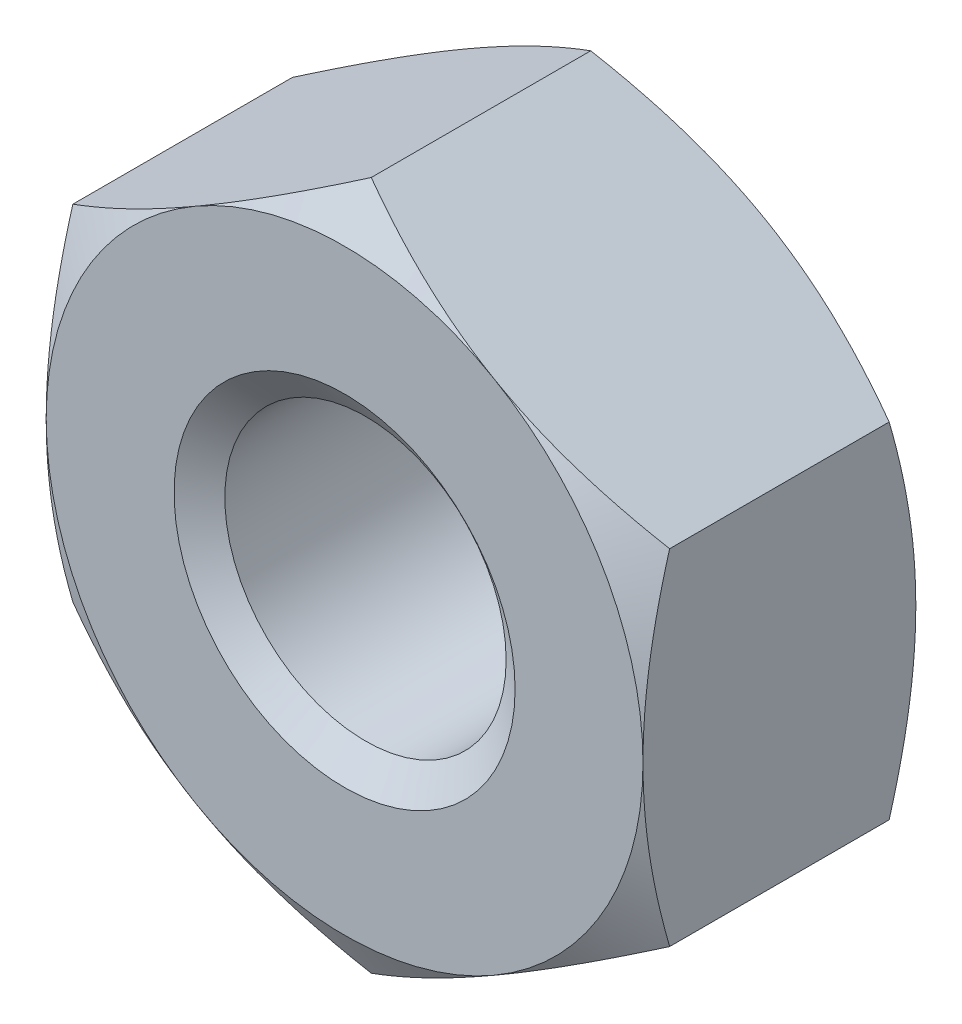
ISO-10303-21;
HEADER;
FILE_DESCRIPTION(('STEP AP214'),'2;1');
FILE_NAME('part.step','',(''),(''),'','','');
FILE_SCHEMA(('AUTOMOTIVE_DESIGN { 1 0 10303 214 1 1 1 1 }'));
ENDSEC;
DATA;
#1=APPLICATION_CONTEXT('core data for automotive mechanical design processes');
#2=APPLICATION_PROTOCOL_DEFINITION('international standard','automotive_design',2000,#1);
#3=PRODUCT_CONTEXT('',#1,'mechanical');
#4=PRODUCT('Part','Part','',(#3));
#5=PRODUCT_RELATED_PRODUCT_CATEGORY('part','',(#4));
#6=PRODUCT_DEFINITION_FORMATION('','',#4);
#7=PRODUCT_DEFINITION_CONTEXT('part definition',#1,'design');
#8=PRODUCT_DEFINITION('design','',#6,#7);
#9=PRODUCT_DEFINITION_SHAPE('','',#8);
#10=(LENGTH_UNIT() NAMED_UNIT(*) SI_UNIT(.MILLI.,.METRE.));
#11=(NAMED_UNIT(*) PLANE_ANGLE_UNIT() SI_UNIT($,.RADIAN.));
#12=(NAMED_UNIT(*) SI_UNIT($,.STERADIAN.) SOLID_ANGLE_UNIT());
#13=UNCERTAINTY_MEASURE_WITH_UNIT(LENGTH_MEASURE(1.E-05),#10,'distance_accuracy_value','');
#14=(GEOMETRIC_REPRESENTATION_CONTEXT(3) GLOBAL_UNCERTAINTY_ASSIGNED_CONTEXT((#13)) GLOBAL_UNIT_ASSIGNED_CONTEXT((#10,
#11,#12)) REPRESENTATION_CONTEXT('',''));
#15=CARTESIAN_POINT('',(0.,0.,0.));
#16=DIRECTION('',(0.,0.,1.));
#17=DIRECTION('',(1.,0.,0.));
#18=AXIS2_PLACEMENT_3D('',#15,#16,#17);
#19=CARTESIAN_POINT('',(0.,0.,-3.2));
#20=DIRECTION('',(0.,0.,1.));
#21=DIRECTION('',(1.,0.,0.));
#22=AXIS2_PLACEMENT_3D('',#19,#20,#21);
#23=CYLINDRICAL_SURFACE('',#22,1.65);
#24=CARTESIAN_POINT('',(0.,0.,-0.245072638373399));
#25=DIRECTION('',(0.,0.,1.));
#26=DIRECTION('',(1.,0.,0.));
#27=AXIS2_PLACEMENT_3D('',#24,#25,#26);
#28=CIRCLE('',#27,1.65);
#29=CARTESIAN_POINT('',(1.65,0.,-0.245072638373399));
#30=VERTEX_POINT('',#29);
#31=EDGE_CURVE('E176',#30,#30,#28,.F.);
#32=ORIENTED_EDGE('',*,*,#31,.F.);
#33=EDGE_LOOP('',(#32));
#34=FACE_BOUND('',#33,.T.);
#35=CARTESIAN_POINT('',(0.,0.,-2.9295273616266));
#36=DIRECTION('',(0.,0.,-1.));
#37=DIRECTION('',(-1.,0.,0.));
#38=AXIS2_PLACEMENT_3D('',#35,#36,#37);
#39=CIRCLE('',#38,1.65);
#40=CARTESIAN_POINT('',(-1.65,0.,-2.9295273616266));
#41=VERTEX_POINT('',#40);
#42=EDGE_CURVE('E41',#41,#41,#39,.F.);
#43=ORIENTED_EDGE('',*,*,#42,.F.);
#44=EDGE_LOOP('',(#43));
#45=FACE_BOUND('',#44,.T.);
#46=ADVANCED_FACE('F36',(#34,#45),#23,.F.);
#47=CARTESIAN_POINT('',(0.,4.04145188432738,-3.2));
#48=DIRECTION('',(-0.500000000000001,0.866025403784438,0.));
#49=DIRECTION('',(-0.866025403784438,-0.500000000000001,0.));
#50=AXIS2_PLACEMENT_3D('',#47,#48,#49);
#51=PLANE('',#50);
#52=DIRECTION('',(0.,0.,1.));
#53=VECTOR('',#52,1.);
#54=CARTESIAN_POINT('',(-3.5,2.02072594216369,-3.2));
#55=LINE('',#54,#53);
#56=CARTESIAN_POINT('',(-3.5,2.02072594216369,-2.88739260883036));
#57=VERTEX_POINT('',#56);
#58=CARTESIAN_POINT('',(-3.5,2.02072594216369,-0.312607391169643));
#59=VERTEX_POINT('',#58);
#60=EDGE_CURVE('E166',#57,#59,#55,.T.);
#61=ORIENTED_EDGE('',*,*,#60,.T.);
#62=CARTESIAN_POINT('',(-3.5002,2.02061047210985,-0.312674060693371));
#63=CARTESIAN_POINT('',(-3.34639282154755,2.10941108799267,-0.261385788989983));
#64=CARTESIAN_POINT('',(-3.19125798916558,2.19897822522909,-0.214740953816197));
#65=CARTESIAN_POINT('',(-2.87830199342322,2.37966345361545,-0.133321875533348));
#66=CARTESIAN_POINT('',(-2.7204752692125,2.47078475532382,-0.0985764355845608));
#67=CARTESIAN_POINT('',(-2.40677778961987,2.65189807961073,-0.0444900271828354));
#68=CARTESIAN_POINT('',(-2.25095530083931,2.74186223545399,-0.0247890862603809));
#69=CARTESIAN_POINT('',(-1.93857711279463,2.92221386641056,-0.00127013273725365));
#70=CARTESIAN_POINT('',(-1.78202254896577,3.01260068598001,0.00256735545443562));
#71=CARTESIAN_POINT('',(-1.48949078007901,3.1814939814933,-0.00541530187697704));
#72=CARTESIAN_POINT('',(-1.35346978754209,3.26002573814993,-0.0152754340696068));
#73=CARTESIAN_POINT('',(-1.08231397971101,3.41657761679354,-0.0465264668994035));
#74=CARTESIAN_POINT('',(-0.947180102315318,3.49459719728458,-0.0679280432857982));
#75=CARTESIAN_POINT('',(-0.675465207594817,3.65147186489429,-0.121430407880577));
#76=CARTESIAN_POINT('',(-0.538918580721665,3.73030709667644,-0.153757994445087));
#77=CARTESIAN_POINT('',(-0.267861907055499,3.88680174018324,-0.227128933807995));
#78=CARTESIAN_POINT('',(-0.133348387531464,3.96446315689009,-0.268155046569868));
#79=CARTESIAN_POINT('',(0.000199999999999524,4.04156735438122,-0.312674060693372));
#80=B_SPLINE_CURVE_WITH_KNOTS('',3,(#62,#63,#64,#65,#66,#67,#68,#69,#70,#71,#72,#73,#74,#75,#76,
#77,#78,#79),.UNSPECIFIED.,.F.,.F.,(4,2,2,2,2,2,2,2,4),(0.,0.554793832886254,1.11092123814984,
1.65328467083219,2.19498204478403,2.6666513085086,3.13875761298267,3.6213361260051,
4.10296698719187),.UNSPECIFIED.);
#81=CARTESIAN_POINT('',(-1.75,3.03108891324553,0.));
#82=VERTEX_POINT('',#81);
#83=EDGE_CURVE('E135',#59,#82,#80,.T.);
#84=ORIENTED_EDGE('',*,*,#83,.T.);
#85=CARTESIAN_POINT('',(0.,4.04145188432738,-0.312607391169644));
#86=VERTEX_POINT('',#85);
#87=EDGE_CURVE('E55',#82,#86,#80,.T.);
#88=ORIENTED_EDGE('',*,*,#87,.T.);
#89=DIRECTION('',(0.,0.,1.));
#90=VECTOR('',#89,1.);
#91=CARTESIAN_POINT('',(0.,4.04145188432738,-3.2));
#92=LINE('',#91,#90);
#93=CARTESIAN_POINT('',(0.,4.04145188432738,-2.88739260883036));
#94=VERTEX_POINT('',#93);
#95=EDGE_CURVE('E151',#94,#86,#92,.T.);
#96=ORIENTED_EDGE('',*,*,#95,.F.);
#97=CARTESIAN_POINT('',(-3.5002,2.02061047210985,-2.88732593930663));
#98=CARTESIAN_POINT('',(-3.34639282154755,2.10941108799267,-2.93861421101002));
#99=CARTESIAN_POINT('',(-3.19125798916558,2.19897822522909,-2.9852590461838));
#100=CARTESIAN_POINT('',(-2.87830199342322,2.37966345361545,-3.06667812446665));
#101=CARTESIAN_POINT('',(-2.7204752692125,2.47078475532382,-3.10142356441544));
#102=CARTESIAN_POINT('',(-2.40677778961987,2.65189807961073,-3.15550997281716));
#103=CARTESIAN_POINT('',(-2.25095530083931,2.74186223545399,-3.17521091373962));
#104=CARTESIAN_POINT('',(-1.93857711279463,2.92221386641055,-3.19872986726275));
#105=CARTESIAN_POINT('',(-1.78202254896577,3.01260068598001,-3.20256735545444));
#106=CARTESIAN_POINT('',(-1.48949078007901,3.1814939814933,-3.19458469812302));
#107=CARTESIAN_POINT('',(-1.35346978754209,3.26002573814993,-3.18472456593039));
#108=CARTESIAN_POINT('',(-1.08231397971101,3.41657761679354,-3.1534735331006));
#109=CARTESIAN_POINT('',(-0.947180102315318,3.49459719728458,-3.1320719567142));
#110=CARTESIAN_POINT('',(-0.675465207594817,3.65147186489429,-3.07856959211942));
#111=CARTESIAN_POINT('',(-0.538918580721665,3.73030709667644,-3.04624200555491));
#112=CARTESIAN_POINT('',(-0.267861907055499,3.88680174018324,-2.97287106619201));
#113=CARTESIAN_POINT('',(-0.133348387531464,3.96446315689009,-2.93184495343013));
#114=CARTESIAN_POINT('',(0.000199999999999536,4.04156735438122,-2.88732593930663));
#115=B_SPLINE_CURVE_WITH_KNOTS('',3,(#97,#98,#99,#100,#101,#102,#103,#104,#105,#106,#107,#108,
#109,#110,#111,#112,#113,#114),.UNSPECIFIED.,.F.,.F.,(4,2,2,2,2,2,2,2,4),(0.,0.554793832886254,
1.11092123814984,1.65328467083219,2.19498204478403,2.6666513085086,3.13875761298267,
3.6213361260051,4.10296698719187),.UNSPECIFIED.);
#116=CARTESIAN_POINT('',(-1.75,3.03108891324553,-3.2));
#117=VERTEX_POINT('',#116);
#118=EDGE_CURVE('E169',#117,#94,#115,.T.);
#119=ORIENTED_EDGE('',*,*,#118,.F.);
#120=EDGE_CURVE('E268',#57,#117,#115,.T.);
#121=ORIENTED_EDGE('',*,*,#120,.F.);
#122=EDGE_LOOP('',(#61,#84,#88,#96,#119,#121));
#123=FACE_BOUND('',#122,.T.);
#124=ADVANCED_FACE('F38',(#123),#51,.T.);
#125=CARTESIAN_POINT('',(3.5,2.02072594216369,-3.2));
#126=DIRECTION('',(0.5,0.866025403784438,0.));
#127=DIRECTION('',(-0.866025403784438,0.5,0.));
#128=AXIS2_PLACEMENT_3D('',#125,#126,#127);
#129=PLANE('',#128);
#130=ORIENTED_EDGE('',*,*,#95,.T.);
#131=CARTESIAN_POINT('',(-0.000200000000000528,4.04156735438122,-0.312674060693372));
#132=CARTESIAN_POINT('',(0.153607178452449,3.9527667384984,-0.261385788989985));
#133=CARTESIAN_POINT('',(0.308742010834424,3.86319960126198,-0.214740953816198));
#134=CARTESIAN_POINT('',(0.621698006576781,3.68251437287562,-0.133321875533349));
#135=CARTESIAN_POINT('',(0.779524730787496,3.59139307116725,-0.0985764355845617));
#136=CARTESIAN_POINT('',(1.09322221038013,3.41027974688034,-0.044490027182836));
#137=CARTESIAN_POINT('',(1.24904469916069,3.32031559103708,-0.0247890862603814));
#138=CARTESIAN_POINT('',(1.56142288720537,3.13996396008052,-0.00127013273725395));
#139=CARTESIAN_POINT('',(1.71797745103423,3.04957714051106,0.0025673554544353));
#140=CARTESIAN_POINT('',(2.01050921992099,2.88068384499777,-0.00541530187697722));
#141=CARTESIAN_POINT('',(2.14653021245791,2.80215208834114,-0.0152754340696068));
#142=CARTESIAN_POINT('',(2.417686020289,2.64560020969753,-0.0465264668994033));
#143=CARTESIAN_POINT('',(2.55281989768468,2.5675806292065,-0.0679280432857978));
#144=CARTESIAN_POINT('',(2.82453479240518,2.41070596159678,-0.121430407880577));
#145=CARTESIAN_POINT('',(2.96108141927834,2.33187072981463,-0.153757994445087));
#146=CARTESIAN_POINT('',(3.2321380929445,2.17537608630783,-0.227128933807994));
#147=CARTESIAN_POINT('',(3.36665161246854,2.09771466960098,-0.268155046569867));
#148=CARTESIAN_POINT('',(3.5002,2.02061047210985,-0.312674060693371));
#149=B_SPLINE_CURVE_WITH_KNOTS('',3,(#131,#132,#133,#134,#135,#136,#137,#138,#139,#140,#141,
#142,#143,#144,#145,#146,#147,#148),.UNSPECIFIED.,.F.,.F.,(4,2,2,2,2,2,2,2,4),(0.,
0.554793832886254,1.11092123814984,1.65328467083219,2.19498204478403,2.6666513085086,
3.13875761298267,3.6213361260051,4.10296698719187),.UNSPECIFIED.);
#150=CARTESIAN_POINT('',(1.75,3.03108891324554,0.));
#151=VERTEX_POINT('',#150);
#152=EDGE_CURVE('E145',#86,#151,#149,.T.);
#153=ORIENTED_EDGE('',*,*,#152,.T.);
#154=CARTESIAN_POINT('',(3.5,2.02072594216369,-0.312607391169644));
#155=VERTEX_POINT('',#154);
#156=EDGE_CURVE('E62',#151,#155,#149,.T.);
#157=ORIENTED_EDGE('',*,*,#156,.T.);
#158=DIRECTION('',(0.,0.,1.));
#159=VECTOR('',#158,1.);
#160=CARTESIAN_POINT('',(3.5,2.02072594216369,-3.2));
#161=LINE('',#160,#159);
#162=CARTESIAN_POINT('',(3.5,2.02072594216369,-2.88739260883036));
#163=VERTEX_POINT('',#162);
#164=EDGE_CURVE('E144',#163,#155,#161,.T.);
#165=ORIENTED_EDGE('',*,*,#164,.F.);
#166=CARTESIAN_POINT('',(-0.000200000000000514,4.04156735438122,-2.88732593930663));
#167=CARTESIAN_POINT('',(0.153607178452449,3.9527667384984,-2.93861421101002));
#168=CARTESIAN_POINT('',(0.308742010834424,3.86319960126198,-2.9852590461838));
#169=CARTESIAN_POINT('',(0.621698006576781,3.68251437287562,-3.06667812446665));
#170=CARTESIAN_POINT('',(0.779524730787496,3.59139307116725,-3.10142356441544));
#171=CARTESIAN_POINT('',(1.09322221038013,3.41027974688034,-3.15550997281716));
#172=CARTESIAN_POINT('',(1.24904469916069,3.32031559103708,-3.17521091373962));
#173=CARTESIAN_POINT('',(1.56142288720537,3.13996396008052,-3.19872986726275));
#174=CARTESIAN_POINT('',(1.71797745103423,3.04957714051106,-3.20256735545444));
#175=CARTESIAN_POINT('',(2.01050921992099,2.88068384499777,-3.19458469812302));
#176=CARTESIAN_POINT('',(2.14653021245791,2.80215208834114,-3.18472456593039));
#177=CARTESIAN_POINT('',(2.417686020289,2.64560020969753,-3.1534735331006));
#178=CARTESIAN_POINT('',(2.55281989768468,2.5675806292065,-3.1320719567142));
#179=CARTESIAN_POINT('',(2.82453479240518,2.41070596159678,-3.07856959211942));
#180=CARTESIAN_POINT('',(2.96108141927834,2.33187072981463,-3.04624200555491));
#181=CARTESIAN_POINT('',(3.2321380929445,2.17537608630783,-2.97287106619201));
#182=CARTESIAN_POINT('',(3.36665161246854,2.09771466960098,-2.93184495343013));
#183=CARTESIAN_POINT('',(3.5002,2.02061047210985,-2.88732593930663));
#184=B_SPLINE_CURVE_WITH_KNOTS('',3,(#166,#167,#168,#169,#170,#171,#172,#173,#174,#175,#176,
#177,#178,#179,#180,#181,#182,#183),.UNSPECIFIED.,.F.,.F.,(4,2,2,2,2,2,2,2,4),(0.,
0.554793832886254,1.11092123814984,1.65328467083219,2.19498204478403,2.6666513085086,
3.13875761298267,3.6213361260051,4.10296698719187),.UNSPECIFIED.);
#185=CARTESIAN_POINT('',(1.75,3.03108891324554,-3.2));
#186=VERTEX_POINT('',#185);
#187=EDGE_CURVE('E261',#186,#163,#184,.T.);
#188=ORIENTED_EDGE('',*,*,#187,.F.);
#189=EDGE_CURVE('E267',#94,#186,#184,.T.);
#190=ORIENTED_EDGE('',*,*,#189,.F.);
#191=EDGE_LOOP('',(#130,#153,#157,#165,#188,#190));
#192=FACE_BOUND('',#191,.T.);
#193=ADVANCED_FACE('F142',(#192),#129,.T.);
#194=CARTESIAN_POINT('',(3.5,2.02072594216369,-3.2));
#195=DIRECTION('',(-1.,0.,0.));
#196=DIRECTION('',(0.,0.,1.));
#197=AXIS2_PLACEMENT_3D('',#194,#195,#196);
#198=PLANE('',#197);
#199=CARTESIAN_POINT('',(3.5,-5.35926299121405,-1.67484346858556));
#200=CARTESIAN_POINT('',(3.5,-5.20559319908841,-1.60058173692104));
#201=CARTESIAN_POINT('',(3.5,-5.05156008083375,-1.52705822833147));
#202=CARTESIAN_POINT('',(3.5,-4.7425707418071,-1.38190950344752));
#203=CARTESIAN_POINT('',(3.5,-4.58761436682436,-1.31028461582133));
#204=CARTESIAN_POINT('',(3.5,-4.27574500225542,-1.16897765517624));
#205=CARTESIAN_POINT('',(3.5,-4.11882589028192,-1.09930904568016));
#206=CARTESIAN_POINT('',(3.5,-3.80369792903855,-0.962964262242759));
#207=CARTESIAN_POINT('',(3.5,-3.64548914750595,-0.896287932319517));
#208=CARTESIAN_POINT('',(3.5,-3.32556618401855,-0.765931819095066));
#209=CARTESIAN_POINT('',(3.5,-3.16383281219923,-0.702298873688864));
#210=CARTESIAN_POINT('',(3.5,-2.83845840945597,-0.580016702089492));
#211=CARTESIAN_POINT('',(3.5,-2.67481716858826,-0.521368030370691));
#212=CARTESIAN_POINT('',(3.5,-2.34570278472049,-0.410630279877021));
#213=CARTESIAN_POINT('',(3.5,-2.18023438248742,-0.358527255435857));
#214=CARTESIAN_POINT('',(3.5,-1.8469452280637,-0.262572936976443));
#215=CARTESIAN_POINT('',(3.5,-1.6791252378753,-0.218719033467158));
#216=CARTESIAN_POINT('',(3.5,-1.34101828610925,-0.141391945584786));
#217=CARTESIAN_POINT('',(3.5,-1.17073068027693,-0.107921525211972));
#218=CARTESIAN_POINT('',(3.5,-0.828102385138484,-0.0536149564320501));
#219=CARTESIAN_POINT('',(3.5,-0.655761694017301,-0.0327788191952362));
#220=CARTESIAN_POINT('',(3.5,-0.311020490924449,-0.00558408650575637));
#221=CARTESIAN_POINT('',(3.5,-0.138627397207259,0.00086616316591159));
#222=CARTESIAN_POINT('',(3.5,0.206038074906535,-0.00105355807794593));
#223=CARTESIAN_POINT('',(3.5,0.37831047302318,-0.00941968196343189));
#224=CARTESIAN_POINT('',(3.5,0.672490555822328,-0.0357688927868921));
#225=CARTESIAN_POINT('',(3.5,0.794722791084093,-0.0503206340384214));
#226=CARTESIAN_POINT('',(3.5,1.0382430543056,-0.0859367340533557));
#227=CARTESIAN_POINT('',(3.5,1.15953093025887,-0.107002119926141));
#228=CARTESIAN_POINT('',(3.5,1.52187914771348,-0.178863187081453));
#229=CARTESIAN_POINT('',(3.5,1.76124104212632,-0.23830527562201));
#230=CARTESIAN_POINT('',(3.5,2.11940971387709,-0.340826814402555));
#231=CARTESIAN_POINT('',(3.5,2.24008344316347,-0.377749699085184));
#232=CARTESIAN_POINT('',(3.5,2.48017139213729,-0.455249007699294));
#233=CARTESIAN_POINT('',(3.5,2.59958641795613,-0.495822911663551));
#234=CARTESIAN_POINT('',(3.5,2.83665760451799,-0.579779986782753));
#235=CARTESIAN_POINT('',(3.5,2.95431988203484,-0.623146060034315));
#236=CARTESIAN_POINT('',(3.5,3.188731535088,-0.712423559566866));
#237=CARTESIAN_POINT('',(3.5,3.30548051959464,-0.75833601459295));
#238=CARTESIAN_POINT('',(3.5,3.42180736613349,-0.805270380724071));
#239=B_SPLINE_CURVE_WITH_KNOTS('',3,(#199,#200,#201,#202,#203,#204,#205,#206,#207,#208,#209,
#210,#211,#212,#213,#214,#215,#216,#217,#218,#219,#220,#221,#222,#223,#224,#225,#226,#227,#228,
#229,#230,#231,#232,#233,#234,#235,#236,#237,#238),.UNSPECIFIED.,.F.,.F.,(4,2,2,2,2,2,2,2,2,2,2,
2,2,2,2,2,2,2,2,4),(0.,0.512025318465737,1.02413870177436,1.53918270315241,2.05419982499223,
2.57553975872798,3.09693761309353,3.617205066104,4.13730766217537,4.65754858684364,
5.17778997146961,5.69470725122282,6.211490334524,6.58059623222331,6.94976036239484,
7.68863804939851,8.06719621660478,8.4454950747676,8.82166461280099,9.1979872473341),.UNSPECIFIED.);
#240=CARTESIAN_POINT('',(3.5,-2.02072594216369,-0.312607391169644));
#241=VERTEX_POINT('',#240);
#242=CARTESIAN_POINT('',(3.5,0.,0.));
#243=VERTEX_POINT('',#242);
#244=EDGE_CURVE('E137',#241,#243,#239,.T.);
#245=ORIENTED_EDGE('',*,*,#244,.F.);
#246=DIRECTION('',(0.,0.,1.));
#247=VECTOR('',#246,1.);
#248=CARTESIAN_POINT('',(3.5,-2.02072594216369,-3.2));
#249=LINE('',#248,#247);
#250=CARTESIAN_POINT('',(3.5,-2.02072594216369,-2.88739260883036));
#251=VERTEX_POINT('',#250);
#252=EDGE_CURVE('E152',#251,#241,#249,.T.);
#253=ORIENTED_EDGE('',*,*,#252,.F.);
#254=CARTESIAN_POINT('',(3.5,-5.35926299121405,-1.52515653141444));
#255=CARTESIAN_POINT('',(3.5,-5.20559319908841,-1.59941826307896));
#256=CARTESIAN_POINT('',(3.5,-5.05156008083375,-1.67294177166853));
#257=CARTESIAN_POINT('',(3.5,-4.7425707418071,-1.81809049655248));
#258=CARTESIAN_POINT('',(3.5,-4.58761436682436,-1.88971538417867));
#259=CARTESIAN_POINT('',(3.5,-4.27574500225542,-2.03102234482376));
#260=CARTESIAN_POINT('',(3.5,-4.11882589028192,-2.10069095431984));
#261=CARTESIAN_POINT('',(3.5,-3.80369792903855,-2.23703573775724));
#262=CARTESIAN_POINT('',(3.5,-3.64548914750595,-2.30371206768048));
#263=CARTESIAN_POINT('',(3.5,-3.32556618401855,-2.43406818090493));
#264=CARTESIAN_POINT('',(3.5,-3.16383281219923,-2.49770112631114));
#265=CARTESIAN_POINT('',(3.5,-2.83845840945597,-2.61998329791051));
#266=CARTESIAN_POINT('',(3.5,-2.67481716858826,-2.67863196962931));
#267=CARTESIAN_POINT('',(3.5,-2.34570278472049,-2.78936972012298));
#268=CARTESIAN_POINT('',(3.5,-2.18023438248742,-2.84147274456414));
#269=CARTESIAN_POINT('',(3.5,-1.8469452280637,-2.93742706302356));
#270=CARTESIAN_POINT('',(3.5,-1.6791252378753,-2.98128096653284));
#271=CARTESIAN_POINT('',(3.5,-1.34101828610925,-3.05860805441521));
#272=CARTESIAN_POINT('',(3.5,-1.17073068027693,-3.09207847478803));
#273=CARTESIAN_POINT('',(3.5,-0.828102385138484,-3.14638504356795));
#274=CARTESIAN_POINT('',(3.5,-0.655761694017301,-3.16722118080476));
#275=CARTESIAN_POINT('',(3.5,-0.311020490924449,-3.19441591349424));
#276=CARTESIAN_POINT('',(3.5,-0.13862739720726,-3.20086616316591));
#277=CARTESIAN_POINT('',(3.5,0.206038074906535,-3.19894644192205));
#278=CARTESIAN_POINT('',(3.5,0.37831047302318,-3.19058031803657));
#279=CARTESIAN_POINT('',(3.5,0.672490555822328,-3.16423110721311));
#280=CARTESIAN_POINT('',(3.5,0.794722791084093,-3.14967936596158));
#281=CARTESIAN_POINT('',(3.5,1.0382430543056,-3.11406326594664));
#282=CARTESIAN_POINT('',(3.5,1.15953093025887,-3.09299788007386));
#283=CARTESIAN_POINT('',(3.5,1.52187914771348,-3.02113681291855));
#284=CARTESIAN_POINT('',(3.5,1.76124104212632,-2.96169472437799));
#285=CARTESIAN_POINT('',(3.5,2.11940971387709,-2.85917318559745));
#286=CARTESIAN_POINT('',(3.5,2.24008344316347,-2.82225030091482));
#287=CARTESIAN_POINT('',(3.5,2.48017139213729,-2.74475099230071));
#288=CARTESIAN_POINT('',(3.5,2.59958641795613,-2.70417708833645));
#289=CARTESIAN_POINT('',(3.5,2.83665760451799,-2.62022001321725));
#290=CARTESIAN_POINT('',(3.5,2.95431988203484,-2.57685393996569));
#291=CARTESIAN_POINT('',(3.5,3.188731535088,-2.48757644043313));
#292=CARTESIAN_POINT('',(3.5,3.30548051959464,-2.44166398540705));
#293=CARTESIAN_POINT('',(3.5,3.42180736613349,-2.39472961927593));
#294=B_SPLINE_CURVE_WITH_KNOTS('',3,(#254,#255,#256,#257,#258,#259,#260,#261,#262,#263,#264,
#265,#266,#267,#268,#269,#270,#271,#272,#273,#274,#275,#276,#277,#278,#279,#280,#281,#282,#283,
#284,#285,#286,#287,#288,#289,#290,#291,#292,#293),.UNSPECIFIED.,.F.,.F.,(4,2,2,2,2,2,2,2,2,2,2,
2,2,2,2,2,2,2,2,4),(0.,0.512025318465737,1.02413870177436,1.53918270315241,2.05419982499223,
2.57553975872798,3.09693761309353,3.617205066104,4.13730766217537,4.65754858684364,
5.17778997146961,5.69470725122282,6.211490334524,6.58059623222331,6.94976036239484,
7.68863804939851,8.06719621660478,8.4454950747676,8.82166461280099,9.1979872473341),.UNSPECIFIED.);
#295=CARTESIAN_POINT('',(3.5,0.,-3.2));
#296=VERTEX_POINT('',#295);
#297=EDGE_CURVE('E275',#251,#296,#294,.T.);
#298=ORIENTED_EDGE('',*,*,#297,.T.);
#299=EDGE_CURVE('E150',#296,#163,#294,.T.);
#300=ORIENTED_EDGE('',*,*,#299,.T.);
#301=ORIENTED_EDGE('',*,*,#164,.T.);
#302=EDGE_CURVE('E127',#243,#155,#239,.T.);
#303=ORIENTED_EDGE('',*,*,#302,.F.);
#304=EDGE_LOOP('',(#245,#253,#298,#300,#301,#303));
#305=FACE_BOUND('',#304,.T.);
#306=ADVANCED_FACE('F148',(#305),#198,.F.);
#307=CARTESIAN_POINT('',(0.,-4.04145188432739,-3.2));
#308=DIRECTION('',(0.5,-0.866025403784438,0.));
#309=DIRECTION('',(0.866025403784438,0.5,0.));
#310=AXIS2_PLACEMENT_3D('',#307,#308,#309);
#311=PLANE('',#310);
#312=ORIENTED_EDGE('',*,*,#252,.T.);
#313=CARTESIAN_POINT('',(3.5002,-2.02061047210986,-0.312674060693372));
#314=CARTESIAN_POINT('',(3.34639282154755,-2.10941108799267,-0.261385788989985));
#315=CARTESIAN_POINT('',(3.19125798916558,-2.19897822522909,-0.214740953816198));
#316=CARTESIAN_POINT('',(2.87830199342322,-2.37966345361545,-0.13332187553335));
#317=CARTESIAN_POINT('',(2.7204752692125,-2.47078475532383,-0.0985764355845625));
#318=CARTESIAN_POINT('',(2.40677778961987,-2.65189807961074,-0.0444900271828371));
#319=CARTESIAN_POINT('',(2.25095530083931,-2.741862235454,-0.0247890862603824));
#320=CARTESIAN_POINT('',(1.93857711279463,-2.92221386641056,-0.0012701327372554));
#321=CARTESIAN_POINT('',(1.78202254896577,-3.01260068598001,0.00256735545443344));
#322=CARTESIAN_POINT('',(1.48949078007901,-3.1814939814933,-0.00541530187697946));
#323=CARTESIAN_POINT('',(1.35346978754209,-3.26002573814993,-0.015275434069609));
#324=CARTESIAN_POINT('',(1.082313979711,-3.41657761679354,-0.0465264668994057));
#325=CARTESIAN_POINT('',(0.947180102315317,-3.49459719728458,-0.0679280432858004));
#326=CARTESIAN_POINT('',(0.675465207594815,-3.65147186489429,-0.12143040788058));
#327=CARTESIAN_POINT('',(0.538918580721664,-3.73030709667644,-0.15375799444509));
#328=CARTESIAN_POINT('',(0.267861907055498,-3.88680174018325,-0.227128933807997));
#329=CARTESIAN_POINT('',(0.133348387531463,-3.96446315689009,-0.26815504656987));
#330=CARTESIAN_POINT('',(-0.000199999999999833,-4.04156735438122,-0.312674060693374));
#331=B_SPLINE_CURVE_WITH_KNOTS('',3,(#313,#314,#315,#316,#317,#318,#319,#320,#321,#322,#323,
#324,#325,#326,#327,#328,#329,#330),.UNSPECIFIED.,.F.,.F.,(4,2,2,2,2,2,2,2,4),(0.,
0.554793832886254,1.11092123814984,1.65328467083219,2.19498204478403,2.6666513085086,
3.13875761298267,3.6213361260051,4.10296698719187),.UNSPECIFIED.);
#332=CARTESIAN_POINT('',(1.75,-3.03108891324553,0.));
#333=VERTEX_POINT('',#332);
#334=EDGE_CURVE('E373',#241,#333,#331,.T.);
#335=ORIENTED_EDGE('',*,*,#334,.T.);
#336=CARTESIAN_POINT('',(0.,-4.04145188432738,-0.312607391169644));
#337=VERTEX_POINT('',#336);
#338=EDGE_CURVE('E229',#333,#337,#331,.T.);
#339=ORIENTED_EDGE('',*,*,#338,.T.);
#340=DIRECTION('',(0.,0.,1.));
#341=VECTOR('',#340,1.);
#342=CARTESIAN_POINT('',(0.,-4.04145188432739,-3.2));
#343=LINE('',#342,#341);
#344=CARTESIAN_POINT('',(0.,-4.04145188432738,-2.88739260883036));
#345=VERTEX_POINT('',#344);
#346=EDGE_CURVE('E157',#345,#337,#343,.T.);
#347=ORIENTED_EDGE('',*,*,#346,.F.);
#348=CARTESIAN_POINT('',(3.5002,-2.02061047210986,-2.88732593930663));
#349=CARTESIAN_POINT('',(3.34639282154755,-2.10941108799267,-2.93861421101002));
#350=CARTESIAN_POINT('',(3.19125798916558,-2.19897822522909,-2.9852590461838));
#351=CARTESIAN_POINT('',(2.87830199342322,-2.37966345361545,-3.06667812446665));
#352=CARTESIAN_POINT('',(2.7204752692125,-2.47078475532383,-3.10142356441544));
#353=CARTESIAN_POINT('',(2.40677778961987,-2.65189807961074,-3.15550997281716));
#354=CARTESIAN_POINT('',(2.25095530083931,-2.741862235454,-3.17521091373962));
#355=CARTESIAN_POINT('',(1.93857711279463,-2.92221386641056,-3.19872986726274));
#356=CARTESIAN_POINT('',(1.78202254896577,-3.01260068598001,-3.20256735545443));
#357=CARTESIAN_POINT('',(1.48949078007901,-3.1814939814933,-3.19458469812302));
#358=CARTESIAN_POINT('',(1.35346978754209,-3.26002573814993,-3.18472456593039));
#359=CARTESIAN_POINT('',(1.082313979711,-3.41657761679354,-3.15347353310059));
#360=CARTESIAN_POINT('',(0.947180102315316,-3.49459719728458,-3.1320719567142));
#361=CARTESIAN_POINT('',(0.675465207594815,-3.65147186489429,-3.07856959211942));
#362=CARTESIAN_POINT('',(0.538918580721664,-3.73030709667644,-3.04624200555491));
#363=CARTESIAN_POINT('',(0.267861907055498,-3.88680174018325,-2.972871066192));
#364=CARTESIAN_POINT('',(0.133348387531463,-3.96446315689009,-2.93184495343013));
#365=CARTESIAN_POINT('',(-0.000199999999999835,-4.04156735438122,-2.88732593930663));
#366=B_SPLINE_CURVE_WITH_KNOTS('',3,(#348,#349,#350,#351,#352,#353,#354,#355,#356,#357,#358,
#359,#360,#361,#362,#363,#364,#365),.UNSPECIFIED.,.F.,.F.,(4,2,2,2,2,2,2,2,4),(0.,
0.554793832886254,1.11092123814984,1.65328467083219,2.19498204478403,2.6666513085086,
3.13875761298267,3.6213361260051,4.10296698719187),.UNSPECIFIED.);
#367=CARTESIAN_POINT('',(1.75,-3.03108891324553,-3.2));
#368=VERTEX_POINT('',#367);
#369=EDGE_CURVE('E282',#368,#345,#366,.T.);
#370=ORIENTED_EDGE('',*,*,#369,.F.);
#371=EDGE_CURVE('E281',#251,#368,#366,.T.);
#372=ORIENTED_EDGE('',*,*,#371,.F.);
#373=EDGE_LOOP('',(#312,#335,#339,#347,#370,#372));
#374=FACE_BOUND('',#373,.T.);
#375=ADVANCED_FACE('F294',(#374),#311,.T.);
#376=CARTESIAN_POINT('',(-3.5,-2.02072594216369,-3.2));
#377=DIRECTION('',(-0.5,-0.866025403784438,0.));
#378=DIRECTION('',(0.866025403784439,-0.5,0.));
#379=AXIS2_PLACEMENT_3D('',#376,#377,#378);
#380=PLANE('',#379);
#381=ORIENTED_EDGE('',*,*,#346,.T.);
#382=CARTESIAN_POINT('',(0.00020000000000034,-4.04156735438122,-0.312674060693374));
#383=CARTESIAN_POINT('',(-0.153607178452449,-3.9527667384984,-0.261385788989986));
#384=CARTESIAN_POINT('',(-0.308742010834424,-3.86319960126198,-0.214740953816199));
#385=CARTESIAN_POINT('',(-0.621698006576782,-3.68251437287563,-0.133321875533351));
#386=CARTESIAN_POINT('',(-0.779524730787497,-3.59139307116725,-0.0985764355845636));
#387=CARTESIAN_POINT('',(-1.09322221038013,-3.41027974688034,-0.0444900271828381));
#388=CARTESIAN_POINT('',(-1.24904469916069,-3.32031559103708,-0.0247890862603834));
#389=CARTESIAN_POINT('',(-1.56142288720538,-3.13996396008052,-0.0012701327372559));
#390=CARTESIAN_POINT('',(-1.71797745103423,-3.04957714051106,0.00256735545443343));
#391=CARTESIAN_POINT('',(-2.01050921992099,-2.88068384499778,-0.0054153018769791));
#392=CARTESIAN_POINT('',(-2.14653021245791,-2.80215208834115,-0.0152754340696087));
#393=CARTESIAN_POINT('',(-2.417686020289,-2.64560020969754,-0.0465264668994052));
#394=CARTESIAN_POINT('',(-2.55281989768468,-2.5675806292065,-0.0679280432857998));
#395=CARTESIAN_POINT('',(-2.82453479240518,-2.41070596159679,-0.121430407880579));
#396=CARTESIAN_POINT('',(-2.96108141927834,-2.33187072981464,-0.153757994445088));
#397=CARTESIAN_POINT('',(-3.2321380929445,-2.17537608630783,-0.227128933807996));
#398=CARTESIAN_POINT('',(-3.36665161246854,-2.09771466960099,-0.268155046569868));
#399=CARTESIAN_POINT('',(-3.5002,-2.02061047210986,-0.312674060693372));
#400=B_SPLINE_CURVE_WITH_KNOTS('',3,(#382,#383,#384,#385,#386,#387,#388,#389,#390,#391,#392,
#393,#394,#395,#396,#397,#398,#399),.UNSPECIFIED.,.F.,.F.,(4,2,2,2,2,2,2,2,4),(0.,
0.554793832886255,1.11092123814984,1.65328467083219,2.19498204478403,2.6666513085086,
3.13875761298267,3.6213361260051,4.10296698719187),.UNSPECIFIED.);
#401=CARTESIAN_POINT('',(-1.75,-3.03108891324554,0.));
#402=VERTEX_POINT('',#401);
#403=EDGE_CURVE('E370',#337,#402,#400,.T.);
#404=ORIENTED_EDGE('',*,*,#403,.T.);
#405=CARTESIAN_POINT('',(-3.5,-2.02072594216369,-0.312607391169644));
#406=VERTEX_POINT('',#405);
#407=EDGE_CURVE('E202',#402,#406,#400,.T.);
#408=ORIENTED_EDGE('',*,*,#407,.T.);
#409=DIRECTION('',(0.,0.,1.));
#410=VECTOR('',#409,1.);
#411=CARTESIAN_POINT('',(-3.5,-2.02072594216369,-3.2));
#412=LINE('',#411,#410);
#413=CARTESIAN_POINT('',(-3.5,-2.02072594216369,-2.88739260883036));
#414=VERTEX_POINT('',#413);
#415=EDGE_CURVE('E163',#414,#406,#412,.T.);
#416=ORIENTED_EDGE('',*,*,#415,.F.);
#417=CARTESIAN_POINT('',(0.00020000000000025,-4.04156735438122,-2.88732593930663));
#418=CARTESIAN_POINT('',(-0.153607178452449,-3.9527667384984,-2.93861421101001));
#419=CARTESIAN_POINT('',(-0.308742010834424,-3.86319960126198,-2.9852590461838));
#420=CARTESIAN_POINT('',(-0.621698006576782,-3.68251437287563,-3.06667812446665));
#421=CARTESIAN_POINT('',(-0.779524730787497,-3.59139307116725,-3.10142356441544));
#422=CARTESIAN_POINT('',(-1.09322221038013,-3.41027974688034,-3.15550997281716));
#423=CARTESIAN_POINT('',(-1.24904469916069,-3.32031559103708,-3.17521091373962));
#424=CARTESIAN_POINT('',(-1.56142288720538,-3.13996396008052,-3.19872986726274));
#425=CARTESIAN_POINT('',(-1.71797745103423,-3.04957714051106,-3.20256735545443));
#426=CARTESIAN_POINT('',(-2.01050921992099,-2.88068384499778,-3.19458469812302));
#427=CARTESIAN_POINT('',(-2.14653021245791,-2.80215208834115,-3.18472456593039));
#428=CARTESIAN_POINT('',(-2.417686020289,-2.64560020969754,-3.1534735331006));
#429=CARTESIAN_POINT('',(-2.55281989768468,-2.5675806292065,-3.1320719567142));
#430=CARTESIAN_POINT('',(-2.82453479240518,-2.41070596159679,-3.07856959211942));
#431=CARTESIAN_POINT('',(-2.96108141927834,-2.33187072981464,-3.04624200555491));
#432=CARTESIAN_POINT('',(-3.2321380929445,-2.17537608630783,-2.972871066192));
#433=CARTESIAN_POINT('',(-3.36665161246854,-2.09771466960099,-2.93184495343013));
#434=CARTESIAN_POINT('',(-3.5002,-2.02061047210986,-2.88732593930663));
#435=B_SPLINE_CURVE_WITH_KNOTS('',3,(#417,#418,#419,#420,#421,#422,#423,#424,#425,#426,#427,
#428,#429,#430,#431,#432,#433,#434),.UNSPECIFIED.,.F.,.F.,(4,2,2,2,2,2,2,2,4),(0.,
0.554793832886254,1.11092123814984,1.65328467083219,2.19498204478403,2.6666513085086,
3.13875761298267,3.6213361260051,4.10296698719187),.UNSPECIFIED.);
#436=CARTESIAN_POINT('',(-1.75,-3.03108891324554,-3.2));
#437=VERTEX_POINT('',#436);
#438=EDGE_CURVE('E289',#437,#414,#435,.T.);
#439=ORIENTED_EDGE('',*,*,#438,.F.);
#440=EDGE_CURVE('E288',#345,#437,#435,.T.);
#441=ORIENTED_EDGE('',*,*,#440,.F.);
#442=EDGE_LOOP('',(#381,#404,#408,#416,#439,#441));
#443=FACE_BOUND('',#442,.T.);
#444=ADVANCED_FACE('F297',(#443),#380,.T.);
#445=CARTESIAN_POINT('',(-3.5,2.02072594216369,-3.2));
#446=DIRECTION('',(-1.,0.,0.));
#447=DIRECTION('',(0.,0.,1.));
#448=AXIS2_PLACEMENT_3D('',#445,#446,#447);
#449=PLANE('',#448);
#450=ORIENTED_EDGE('',*,*,#415,.T.);
#451=CARTESIAN_POINT('',(-3.5,-5.35926299121405,-1.67484346858556));
#452=CARTESIAN_POINT('',(-3.5,-5.20559319908842,-1.60058173692104));
#453=CARTESIAN_POINT('',(-3.5,-5.05156008083375,-1.52705822833147));
#454=CARTESIAN_POINT('',(-3.5,-4.7425707418071,-1.38190950344752));
#455=CARTESIAN_POINT('',(-3.5,-4.58761436682436,-1.31028461582133));
#456=CARTESIAN_POINT('',(-3.5,-4.27574500225542,-1.16897765517624));
#457=CARTESIAN_POINT('',(-3.5,-4.11882589028192,-1.09930904568016));
#458=CARTESIAN_POINT('',(-3.5,-3.80369792903855,-0.96296426224276));
#459=CARTESIAN_POINT('',(-3.5,-3.64548914750595,-0.896287932319518));
#460=CARTESIAN_POINT('',(-3.5,-3.32556618401855,-0.765931819095067));
#461=CARTESIAN_POINT('',(-3.5,-3.16383281219924,-0.702298873688865));
#462=CARTESIAN_POINT('',(-3.5,-2.83845840945597,-0.580016702089493));
#463=CARTESIAN_POINT('',(-3.5,-2.67481716858826,-0.521368030370692));
#464=CARTESIAN_POINT('',(-3.5,-2.34570278472049,-0.410630279877022));
#465=CARTESIAN_POINT('',(-3.5,-2.18023438248742,-0.358527255435857));
#466=CARTESIAN_POINT('',(-3.5,-1.8469452280637,-0.262572936976443));
#467=CARTESIAN_POINT('',(-3.5,-1.6791252378753,-0.218719033467158));
#468=CARTESIAN_POINT('',(-3.5,-1.34101828610925,-0.141391945584787));
#469=CARTESIAN_POINT('',(-3.5,-1.17073068027693,-0.107921525211973));
#470=CARTESIAN_POINT('',(-3.5,-0.828102385138485,-0.0536149564320504));
#471=CARTESIAN_POINT('',(-3.5,-0.655761694017302,-0.0327788191952365));
#472=CARTESIAN_POINT('',(-3.5,-0.31102049092445,-0.00558408650575658));
#473=CARTESIAN_POINT('',(-3.5,-0.13862739720726,0.000866163165911488));
#474=CARTESIAN_POINT('',(-3.5,0.206038074906534,-0.00105355807794583));
#475=CARTESIAN_POINT('',(-3.5,0.378310473023179,-0.00941968196343169));
#476=CARTESIAN_POINT('',(-3.5,0.672490555822327,-0.0357688927868918));
#477=CARTESIAN_POINT('',(-3.5,0.794722791084092,-0.0503206340384211));
#478=CARTESIAN_POINT('',(-3.5,1.0382430543056,-0.0859367340533555));
#479=CARTESIAN_POINT('',(-3.5,1.15953093025887,-0.107002119926141));
#480=CARTESIAN_POINT('',(-3.5,1.52187914771348,-0.178863187081452));
#481=CARTESIAN_POINT('',(-3.5,1.76124104212632,-0.23830527562201));
#482=CARTESIAN_POINT('',(-3.5,2.11940971387708,-0.340826814402554));
#483=CARTESIAN_POINT('',(-3.5,2.24008344316346,-0.377749699085183));
#484=CARTESIAN_POINT('',(-3.5,2.48017139213729,-0.455249007699293));
#485=CARTESIAN_POINT('',(-3.5,2.59958641795613,-0.49582291166355));
#486=CARTESIAN_POINT('',(-3.5,2.83665760451799,-0.579779986782752));
#487=CARTESIAN_POINT('',(-3.5,2.95431988203484,-0.623146060034314));
#488=CARTESIAN_POINT('',(-3.5,3.188731535088,-0.712423559566866));
#489=CARTESIAN_POINT('',(-3.5,3.30548051959464,-0.75833601459295));
#490=CARTESIAN_POINT('',(-3.5,3.42180736613349,-0.805270380724071));
#491=B_SPLINE_CURVE_WITH_KNOTS('',3,(#451,#452,#453,#454,#455,#456,#457,#458,#459,#460,#461,
#462,#463,#464,#465,#466,#467,#468,#469,#470,#471,#472,#473,#474,#475,#476,#477,#478,#479,#480,
#481,#482,#483,#484,#485,#486,#487,#488,#489,#490),.UNSPECIFIED.,.F.,.F.,(4,2,2,2,2,2,2,2,2,2,2,
2,2,2,2,2,2,2,2,4),(0.,0.512025318465737,1.02413870177436,1.53918270315241,2.05419982499223,
2.57553975872798,3.09693761309353,3.617205066104,4.13730766217537,4.65754858684364,
5.17778997146961,5.69470725122282,6.211490334524,6.58059623222331,6.94976036239484,
7.68863804939851,8.06719621660478,8.4454950747676,8.82166461280099,9.1979872473341),.UNSPECIFIED.);
#492=CARTESIAN_POINT('',(-3.5,0.,0.));
#493=VERTEX_POINT('',#492);
#494=EDGE_CURVE('E201',#406,#493,#491,.T.);
#495=ORIENTED_EDGE('',*,*,#494,.T.);
#496=EDGE_CURVE('E193',#493,#59,#491,.T.);
#497=ORIENTED_EDGE('',*,*,#496,.T.);
#498=ORIENTED_EDGE('',*,*,#60,.F.);
#499=CARTESIAN_POINT('',(-3.5,-5.35926299121405,-1.52515653141444));
#500=CARTESIAN_POINT('',(-3.5,-5.20559319908841,-1.59941826307896));
#501=CARTESIAN_POINT('',(-3.5,-5.05156008083375,-1.67294177166853));
#502=CARTESIAN_POINT('',(-3.5,-4.7425707418071,-1.81809049655248));
#503=CARTESIAN_POINT('',(-3.5,-4.58761436682437,-1.88971538417867));
#504=CARTESIAN_POINT('',(-3.5,-4.27574500225542,-2.03102234482376));
#505=CARTESIAN_POINT('',(-3.5,-4.11882589028192,-2.10069095431984));
#506=CARTESIAN_POINT('',(-3.5,-3.80369792903855,-2.23703573775724));
#507=CARTESIAN_POINT('',(-3.5,-3.64548914750595,-2.30371206768048));
#508=CARTESIAN_POINT('',(-3.5,-3.32556618401855,-2.43406818090493));
#509=CARTESIAN_POINT('',(-3.5,-3.16383281219924,-2.49770112631114));
#510=CARTESIAN_POINT('',(-3.5,-2.83845840945597,-2.61998329791051));
#511=CARTESIAN_POINT('',(-3.5,-2.67481716858826,-2.67863196962931));
#512=CARTESIAN_POINT('',(-3.5,-2.34570278472049,-2.78936972012298));
#513=CARTESIAN_POINT('',(-3.5,-2.18023438248742,-2.84147274456414));
#514=CARTESIAN_POINT('',(-3.5,-1.8469452280637,-2.93742706302356));
#515=CARTESIAN_POINT('',(-3.5,-1.6791252378753,-2.98128096653284));
#516=CARTESIAN_POINT('',(-3.5,-1.34101828610925,-3.05860805441521));
#517=CARTESIAN_POINT('',(-3.5,-1.17073068027693,-3.09207847478803));
#518=CARTESIAN_POINT('',(-3.5,-0.828102385138485,-3.14638504356795));
#519=CARTESIAN_POINT('',(-3.5,-0.655761694017302,-3.16722118080476));
#520=CARTESIAN_POINT('',(-3.5,-0.31102049092445,-3.19441591349424));
#521=CARTESIAN_POINT('',(-3.5,-0.13862739720726,-3.20086616316591));
#522=CARTESIAN_POINT('',(-3.5,0.206038074906535,-3.19894644192205));
#523=CARTESIAN_POINT('',(-3.5,0.378310473023179,-3.19058031803657));
#524=CARTESIAN_POINT('',(-3.5,0.672490555822327,-3.16423110721311));
#525=CARTESIAN_POINT('',(-3.5,0.794722791084092,-3.14967936596158));
#526=CARTESIAN_POINT('',(-3.5,1.0382430543056,-3.11406326594664));
#527=CARTESIAN_POINT('',(-3.5,1.15953093025887,-3.09299788007386));
#528=CARTESIAN_POINT('',(-3.5,1.52187914771348,-3.02113681291855));
#529=CARTESIAN_POINT('',(-3.5,1.76124104212632,-2.96169472437799));
#530=CARTESIAN_POINT('',(-3.5,2.11940971387708,-2.85917318559745));
#531=CARTESIAN_POINT('',(-3.5,2.24008344316346,-2.82225030091482));
#532=CARTESIAN_POINT('',(-3.5,2.48017139213729,-2.74475099230071));
#533=CARTESIAN_POINT('',(-3.5,2.59958641795613,-2.70417708833645));
#534=CARTESIAN_POINT('',(-3.5,2.83665760451798,-2.62022001321725));
#535=CARTESIAN_POINT('',(-3.5,2.95431988203484,-2.57685393996569));
#536=CARTESIAN_POINT('',(-3.5,3.188731535088,-2.48757644043313));
#537=CARTESIAN_POINT('',(-3.5,3.30548051959464,-2.44166398540705));
#538=CARTESIAN_POINT('',(-3.5,3.42180736613349,-2.39472961927593));
#539=B_SPLINE_CURVE_WITH_KNOTS('',3,(#499,#500,#501,#502,#503,#504,#505,#506,#507,#508,#509,
#510,#511,#512,#513,#514,#515,#516,#517,#518,#519,#520,#521,#522,#523,#524,#525,#526,#527,#528,
#529,#530,#531,#532,#533,#534,#535,#536,#537,#538),.UNSPECIFIED.,.F.,.F.,(4,2,2,2,2,2,2,2,2,2,2,
2,2,2,2,2,2,2,2,4),(0.,0.512025318465737,1.02413870177436,1.53918270315241,2.05419982499223,
2.57553975872798,3.09693761309353,3.617205066104,4.13730766217537,4.65754858684364,
5.17778997146961,5.69470725122282,6.211490334524,6.58059623222331,6.94976036239485,
7.68863804939851,8.06719621660478,8.4454950747676,8.82166461280099,9.1979872473341),.UNSPECIFIED.);
#540=CARTESIAN_POINT('',(-3.5,0.,-3.2));
#541=VERTEX_POINT('',#540);
#542=EDGE_CURVE('E341',#541,#57,#539,.T.);
#543=ORIENTED_EDGE('',*,*,#542,.F.);
#544=EDGE_CURVE('E344',#414,#541,#539,.T.);
#545=ORIENTED_EDGE('',*,*,#544,.F.);
#546=EDGE_LOOP('',(#450,#495,#497,#498,#543,#545));
#547=FACE_BOUND('',#546,.T.);
#548=ADVANCED_FACE('F209',(#547),#449,.T.);
#549=CARTESIAN_POINT('',(0.,4.04145188432738,0.));
#550=DIRECTION('',(0.,0.,-1.));
#551=DIRECTION('',(-1.,0.,0.));
#552=AXIS2_PLACEMENT_3D('',#549,#550,#551);
#553=PLANE('',#552);
#554=CARTESIAN_POINT('',(0.,0.,0.));
#555=DIRECTION('',(0.,0.,1.));
#556=DIRECTION('',(1.,0.,0.));
#557=AXIS2_PLACEMENT_3D('',#554,#555,#556);
#558=CIRCLE('',#557,2.);
#559=CARTESIAN_POINT('',(2.,0.,0.));
#560=VERTEX_POINT('',#559);
#561=EDGE_CURVE('E178',#560,#560,#558,.T.);
#562=ORIENTED_EDGE('',*,*,#561,.F.);
#563=EDGE_LOOP('',(#562));
#564=FACE_BOUND('',#563,.T.);
#565=CARTESIAN_POINT('',(0.,0.,0.));
#566=DIRECTION('',(0.,0.,-1.));
#567=DIRECTION('',(-1.,0.,0.));
#568=AXIS2_PLACEMENT_3D('',#565,#566,#567);
#569=CIRCLE('',#568,3.5);
#570=EDGE_CURVE('E11',#493,#82,#569,.T.);
#571=ORIENTED_EDGE('',*,*,#570,.F.);
#572=EDGE_CURVE('E48',#402,#493,#569,.T.);
#573=ORIENTED_EDGE('',*,*,#572,.F.);
#574=EDGE_CURVE('E175',#333,#402,#569,.T.);
#575=ORIENTED_EDGE('',*,*,#574,.F.);
#576=EDGE_CURVE('E377',#243,#333,#569,.T.);
#577=ORIENTED_EDGE('',*,*,#576,.F.);
#578=CARTESIAN_POINT('',(0.,0.,0.));
#579=DIRECTION('',(0.,0.,1.));
#580=DIRECTION('',(1.,0.,0.));
#581=AXIS2_PLACEMENT_3D('',#578,#579,#580);
#582=CIRCLE('',#581,3.5);
#583=EDGE_CURVE('E130',#243,#151,#582,.T.);
#584=ORIENTED_EDGE('',*,*,#583,.T.);
#585=EDGE_CURVE('E46',#82,#151,#569,.T.);
#586=ORIENTED_EDGE('',*,*,#585,.F.);
#587=EDGE_LOOP('',(#571,#573,#575,#577,#584,#586));
#588=FACE_BOUND('',#587,.T.);
#589=ADVANCED_FACE('F257',(#564,#588),#553,.F.);
#590=CARTESIAN_POINT('',(0.,4.04145188432738,-3.2));
#591=DIRECTION('',(0.,0.,-1.));
#592=DIRECTION('',(-1.,0.,0.));
#593=AXIS2_PLACEMENT_3D('',#590,#591,#592);
#594=PLANE('',#593);
#595=CARTESIAN_POINT('',(0.,0.,-3.2));
#596=DIRECTION('',(0.,0.,-1.));
#597=DIRECTION('',(-1.,0.,0.));
#598=AXIS2_PLACEMENT_3D('',#595,#596,#597);
#599=CIRCLE('',#598,2.);
#600=CARTESIAN_POINT('',(-2.,0.,-3.2));
#601=VERTEX_POINT('',#600);
#602=EDGE_CURVE('E179',#601,#601,#599,.F.);
#603=ORIENTED_EDGE('',*,*,#602,.T.);
#604=EDGE_LOOP('',(#603));
#605=FACE_BOUND('',#604,.T.);
#606=CARTESIAN_POINT('',(0.,0.,-3.2));
#607=DIRECTION('',(0.,0.,-1.));
#608=DIRECTION('',(-1.,0.,0.));
#609=AXIS2_PLACEMENT_3D('',#606,#607,#608);
#610=CIRCLE('',#609,3.5);
#611=EDGE_CURVE('E172',#541,#437,#610,.F.);
#612=ORIENTED_EDGE('',*,*,#611,.F.);
#613=EDGE_CURVE('E154',#117,#541,#610,.F.);
#614=ORIENTED_EDGE('',*,*,#613,.F.);
#615=EDGE_CURVE('E171',#186,#117,#610,.F.);
#616=ORIENTED_EDGE('',*,*,#615,.F.);
#617=CARTESIAN_POINT('',(0.,0.,-3.2));
#618=DIRECTION('',(0.,0.,1.));
#619=DIRECTION('',(1.,0.,0.));
#620=AXIS2_PLACEMENT_3D('',#617,#618,#619);
#621=CIRCLE('',#620,3.5);
#622=EDGE_CURVE('E252',#296,#186,#621,.T.);
#623=ORIENTED_EDGE('',*,*,#622,.F.);
#624=EDGE_CURVE('E357',#368,#296,#610,.F.);
#625=ORIENTED_EDGE('',*,*,#624,.F.);
#626=EDGE_CURVE('E336',#437,#368,#610,.F.);
#627=ORIENTED_EDGE('',*,*,#626,.F.);
#628=EDGE_LOOP('',(#612,#614,#616,#623,#625,#627));
#629=FACE_BOUND('',#628,.T.);
#630=ADVANCED_FACE('F316',(#605,#629),#594,.T.);
#631=CARTESIAN_POINT('',(0.,0.,-3.2));
#632=DIRECTION('',(0.,0.,1.));
#633=DIRECTION('',(1.,0.,0.));
#634=AXIS2_PLACEMENT_3D('',#631,#632,#633);
#635=CONICAL_SURFACE('',#634,3.5,1.0471975511966);
#636=ORIENTED_EDGE('',*,*,#120,.T.);
#637=ORIENTED_EDGE('',*,*,#613,.T.);
#638=ORIENTED_EDGE('',*,*,#542,.T.);
#639=EDGE_LOOP('',(#636,#637,#638));
#640=FACE_BOUND('',#639,.T.);
#641=ADVANCED_FACE('F318',(#640),#635,.T.);
#642=ORIENTED_EDGE('',*,*,#118,.T.);
#643=ORIENTED_EDGE('',*,*,#189,.T.);
#644=ORIENTED_EDGE('',*,*,#615,.T.);
#645=EDGE_LOOP('',(#642,#643,#644));
#646=FACE_BOUND('',#645,.T.);
#647=ADVANCED_FACE('F323',(#646),#635,.T.);
#648=ORIENTED_EDGE('',*,*,#187,.T.);
#649=ORIENTED_EDGE('',*,*,#299,.F.);
#650=ORIENTED_EDGE('',*,*,#622,.T.);
#651=EDGE_LOOP('',(#648,#649,#650));
#652=FACE_BOUND('',#651,.T.);
#653=ADVANCED_FACE('F380',(#652),#635,.T.);
#654=ORIENTED_EDGE('',*,*,#371,.T.);
#655=ORIENTED_EDGE('',*,*,#624,.T.);
#656=ORIENTED_EDGE('',*,*,#297,.F.);
#657=EDGE_LOOP('',(#654,#655,#656));
#658=FACE_BOUND('',#657,.T.);
#659=ADVANCED_FACE('F326',(#658),#635,.T.);
#660=ORIENTED_EDGE('',*,*,#369,.T.);
#661=ORIENTED_EDGE('',*,*,#440,.T.);
#662=ORIENTED_EDGE('',*,*,#626,.T.);
#663=EDGE_LOOP('',(#660,#661,#662));
#664=FACE_BOUND('',#663,.T.);
#665=ADVANCED_FACE('F325',(#664),#635,.T.);
#666=ORIENTED_EDGE('',*,*,#438,.T.);
#667=ORIENTED_EDGE('',*,*,#544,.T.);
#668=ORIENTED_EDGE('',*,*,#611,.T.);
#669=EDGE_LOOP('',(#666,#667,#668));
#670=FACE_BOUND('',#669,.T.);
#671=ADVANCED_FACE('F217',(#670),#635,.T.);
#672=CARTESIAN_POINT('',(0.,0.,0.));
#673=DIRECTION('',(0.,0.,-1.));
#674=DIRECTION('',(-1.,0.,0.));
#675=AXIS2_PLACEMENT_3D('',#672,#673,#674);
#676=CONICAL_SURFACE('',#675,3.5,1.0471975511966);
#677=ORIENTED_EDGE('',*,*,#572,.T.);
#678=ORIENTED_EDGE('',*,*,#494,.F.);
#679=ORIENTED_EDGE('',*,*,#407,.F.);
#680=EDGE_LOOP('',(#677,#678,#679));
#681=FACE_BOUND('',#680,.T.);
#682=ADVANCED_FACE('F211',(#681),#676,.T.);
#683=ORIENTED_EDGE('',*,*,#574,.T.);
#684=ORIENTED_EDGE('',*,*,#403,.F.);
#685=ORIENTED_EDGE('',*,*,#338,.F.);
#686=EDGE_LOOP('',(#683,#684,#685));
#687=FACE_BOUND('',#686,.T.);
#688=ADVANCED_FACE('F216',(#687),#676,.T.);
#689=ORIENTED_EDGE('',*,*,#244,.T.);
#690=ORIENTED_EDGE('',*,*,#576,.T.);
#691=ORIENTED_EDGE('',*,*,#334,.F.);
#692=EDGE_LOOP('',(#689,#690,#691));
#693=FACE_BOUND('',#692,.T.);
#694=ADVANCED_FACE('F376',(#693),#676,.T.);
#695=ORIENTED_EDGE('',*,*,#583,.F.);
#696=ORIENTED_EDGE('',*,*,#302,.T.);
#697=ORIENTED_EDGE('',*,*,#156,.F.);
#698=EDGE_LOOP('',(#695,#696,#697));
#699=FACE_BOUND('',#698,.T.);
#700=ADVANCED_FACE('F128',(#699),#676,.T.);
#701=ORIENTED_EDGE('',*,*,#585,.T.);
#702=ORIENTED_EDGE('',*,*,#152,.F.);
#703=ORIENTED_EDGE('',*,*,#87,.F.);
#704=EDGE_LOOP('',(#701,#702,#703));
#705=FACE_BOUND('',#704,.T.);
#706=ADVANCED_FACE('F219',(#705),#676,.T.);
#707=ORIENTED_EDGE('',*,*,#496,.F.);
#708=ORIENTED_EDGE('',*,*,#570,.T.);
#709=ORIENTED_EDGE('',*,*,#83,.F.);
#710=EDGE_LOOP('',(#707,#708,#709));
#711=FACE_BOUND('',#710,.T.);
#712=ADVANCED_FACE('F406',(#711),#676,.T.);
#713=CARTESIAN_POINT('',(0.,0.,-0.269579902210739));
#714=DIRECTION('',(0.,0.,1.));
#715=DIRECTION('',(1.,0.,0.));
#716=AXIS2_PLACEMENT_3D('',#713,#714,#715);
#717=CONICAL_SURFACE('',#716,1.615,0.95993108859688);
#718=ORIENTED_EDGE('',*,*,#561,.T.);
#719=EDGE_LOOP('',(#718));
#720=FACE_BOUND('',#719,.T.);
#721=ORIENTED_EDGE('',*,*,#31,.T.);
#722=EDGE_LOOP('',(#721));
#723=FACE_BOUND('',#722,.T.);
#724=ADVANCED_FACE('F220',(#720,#723),#717,.F.);
#725=CARTESIAN_POINT('',(0.,0.,-3.1746));
#726=DIRECTION('',(0.,0.,-1.));
#727=DIRECTION('',(-1.,0.,0.));
#728=AXIS2_PLACEMENT_3D('',#725,#726,#727);
#729=CONICAL_SURFACE('',#728,2.,0.95993108859688);
#730=CARTESIAN_POINT('',(0.,0.,-3.1746));
#731=DIRECTION('',(0.,0.,1.));
#732=DIRECTION('',(1.,0.,0.));
#733=AXIS2_PLACEMENT_3D('',#730,#731,#732);
#734=CIRCLE('',#733,2.);
#735=CARTESIAN_POINT('',(2.,0.,-3.1746));
#736=VERTEX_POINT('',#735);
#737=EDGE_CURVE('E181',#736,#736,#734,.T.);
#738=ORIENTED_EDGE('',*,*,#737,.F.);
#739=EDGE_LOOP('',(#738));
#740=FACE_BOUND('',#739,.T.);
#741=ORIENTED_EDGE('',*,*,#42,.T.);
#742=EDGE_LOOP('',(#741));
#743=FACE_BOUND('',#742,.T.);
#744=ADVANCED_FACE('F434',(#740,#743),#729,.F.);
#745=CARTESIAN_POINT('',(0.,0.,-25.0375057290932));
#746=DIRECTION('',(0.,0.,1.));
#747=DIRECTION('',(1.,0.,0.));
#748=AXIS2_PLACEMENT_3D('',#745,#746,#747);
#749=CYLINDRICAL_SURFACE('',#748,2.);
#750=ORIENTED_EDGE('',*,*,#602,.F.);
#751=EDGE_LOOP('',(#750));
#752=FACE_BOUND('',#751,.T.);
#753=ORIENTED_EDGE('',*,*,#737,.T.);
#754=EDGE_LOOP('',(#753));
#755=FACE_BOUND('',#754,.T.);
#756=ADVANCED_FACE('F441',(#752,#755),#749,.F.);
#757=CLOSED_SHELL('',(#46,#124,#193,#306,#375,#444,#548,#589,#630,#641,#647,#653,#659,#665,#671,
#682,#688,#694,#700,#706,#712,#724,#744,#756));
#758=MANIFOLD_SOLID_BREP('B2',#757);
#759=ADVANCED_BREP_SHAPE_REPRESENTATION('',(#18,#758),#14);
#760=SHAPE_DEFINITION_REPRESENTATION(#9,#759);
ENDSEC;
END-ISO-10303-21;
